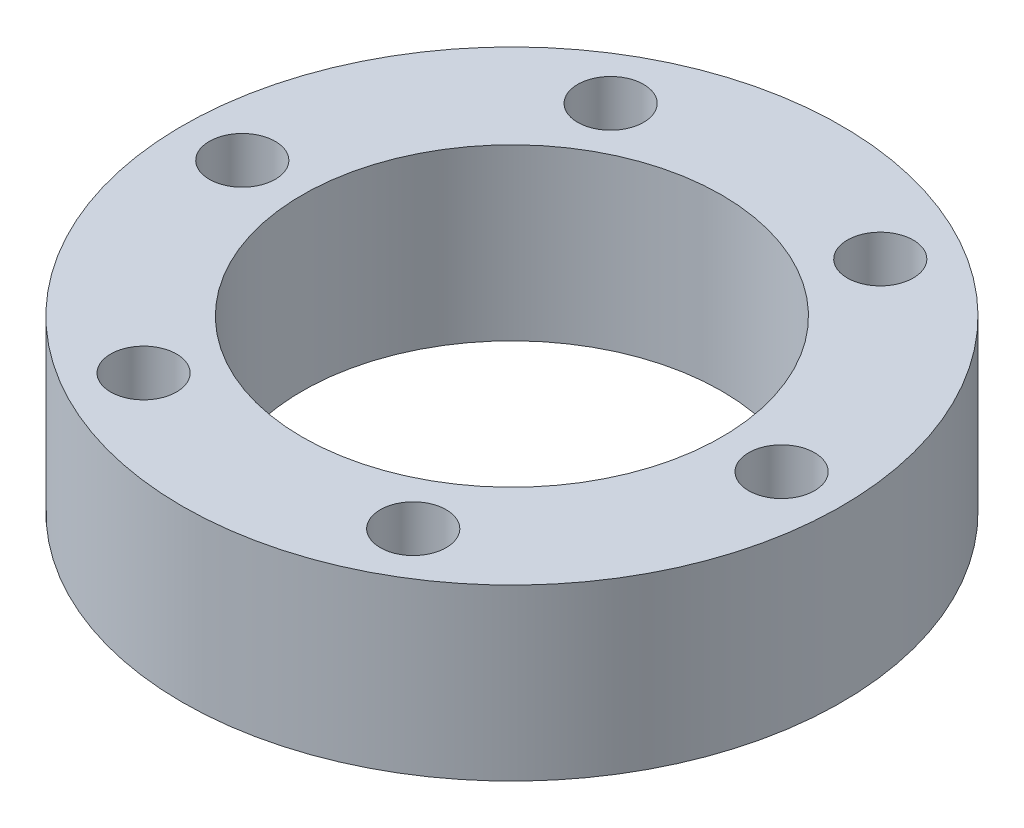
ISO-10303-21;
HEADER;
FILE_DESCRIPTION(('STEP AP214'),'2;1');
FILE_NAME('part.step','',(''),(''),'','','');
FILE_SCHEMA(('AUTOMOTIVE_DESIGN { 1 0 10303 214 1 1 1 1 }'));
ENDSEC;
DATA;
#1=APPLICATION_CONTEXT('core data for automotive mechanical design processes');
#2=APPLICATION_PROTOCOL_DEFINITION('international standard','automotive_design',2000,#1);
#3=PRODUCT_CONTEXT('',#1,'mechanical');
#4=PRODUCT('Part','Part','',(#3));
#5=PRODUCT_RELATED_PRODUCT_CATEGORY('part','',(#4));
#6=PRODUCT_DEFINITION_FORMATION('','',#4);
#7=PRODUCT_DEFINITION_CONTEXT('part definition',#1,'design');
#8=PRODUCT_DEFINITION('design','',#6,#7);
#9=PRODUCT_DEFINITION_SHAPE('','',#8);
#10=(LENGTH_UNIT() NAMED_UNIT(*) SI_UNIT(.MILLI.,.METRE.));
#11=(NAMED_UNIT(*) PLANE_ANGLE_UNIT() SI_UNIT($,.RADIAN.));
#12=(NAMED_UNIT(*) SI_UNIT($,.STERADIAN.) SOLID_ANGLE_UNIT());
#13=UNCERTAINTY_MEASURE_WITH_UNIT(LENGTH_MEASURE(1.E-05),#10,'distance_accuracy_value','');
#14=(GEOMETRIC_REPRESENTATION_CONTEXT(3) GLOBAL_UNCERTAINTY_ASSIGNED_CONTEXT((#13)) GLOBAL_UNIT_ASSIGNED_CONTEXT((#10,
#11,#12)) REPRESENTATION_CONTEXT('',''));
#15=CARTESIAN_POINT('',(0.,0.,0.));
#16=DIRECTION('',(0.,0.,1.));
#17=DIRECTION('',(1.,0.,0.));
#18=AXIS2_PLACEMENT_3D('',#15,#16,#17);
#19=CARTESIAN_POINT('',(0.,17.,0.));
#20=DIRECTION('',(0.,1.,0.));
#21=DIRECTION('',(0.,0.,1.));
#22=AXIS2_PLACEMENT_3D('',#19,#20,#21);
#23=PLANE('',#22);
#24=CARTESIAN_POINT('',(-13.5000000000003,17.,-23.3826859021797));
#25=DIRECTION('',(0.,1.,0.));
#26=DIRECTION('',(0.,0.,1.));
#27=AXIS2_PLACEMENT_3D('',#24,#25,#26);
#28=CIRCLE('',#27,3.29999999999999);
#29=CARTESIAN_POINT('',(-13.5000000000003,17.,-20.0826859021797));
#30=VERTEX_POINT('',#29);
#31=EDGE_CURVE('E83',#30,#30,#28,.T.);
#32=ORIENTED_EDGE('',*,*,#31,.F.);
#33=EDGE_LOOP('',(#32));
#34=FACE_BOUND('',#33,.T.);
#35=CARTESIAN_POINT('',(13.4999999999998,17.,-23.38268590218));
#36=DIRECTION('',(0.,1.,0.));
#37=DIRECTION('',(0.,0.,1.));
#38=AXIS2_PLACEMENT_3D('',#35,#36,#37);
#39=CIRCLE('',#38,3.29999999999999);
#40=CARTESIAN_POINT('',(13.4999999999998,17.,-20.08268590218));
#41=VERTEX_POINT('',#40);
#42=EDGE_CURVE('E77',#41,#41,#39,.T.);
#43=ORIENTED_EDGE('',*,*,#42,.F.);
#44=EDGE_LOOP('',(#43));
#45=FACE_BOUND('',#44,.T.);
#46=CARTESIAN_POINT('',(27.,17.,0.));
#47=DIRECTION('',(0.,1.,0.));
#48=DIRECTION('',(0.,0.,1.));
#49=AXIS2_PLACEMENT_3D('',#46,#47,#48);
#50=CIRCLE('',#49,3.29999999999999);
#51=CARTESIAN_POINT('',(27.,17.,3.29999999999999));
#52=VERTEX_POINT('',#51);
#53=EDGE_CURVE('E71',#52,#52,#50,.T.);
#54=ORIENTED_EDGE('',*,*,#53,.F.);
#55=EDGE_LOOP('',(#54));
#56=FACE_BOUND('',#55,.T.);
#57=CARTESIAN_POINT('',(13.5000000000001,17.,23.3826859021798));
#58=DIRECTION('',(0.,1.,0.));
#59=DIRECTION('',(0.,0.,1.));
#60=AXIS2_PLACEMENT_3D('',#57,#58,#59);
#61=CIRCLE('',#60,3.29999999999999);
#62=CARTESIAN_POINT('',(13.5000000000001,17.,26.6826859021798));
#63=VERTEX_POINT('',#62);
#64=EDGE_CURVE('E65',#63,#63,#61,.T.);
#65=ORIENTED_EDGE('',*,*,#64,.F.);
#66=EDGE_LOOP('',(#65));
#67=FACE_BOUND('',#66,.T.);
#68=CARTESIAN_POINT('',(-13.4999999999999,17.,23.3826859021799));
#69=DIRECTION('',(0.,1.,0.));
#70=DIRECTION('',(0.,0.,1.));
#71=AXIS2_PLACEMENT_3D('',#68,#69,#70);
#72=CIRCLE('',#71,3.29999999999999);
#73=CARTESIAN_POINT('',(-13.4999999999999,17.,26.6826859021799));
#74=VERTEX_POINT('',#73);
#75=EDGE_CURVE('E59',#74,#74,#72,.T.);
#76=ORIENTED_EDGE('',*,*,#75,.F.);
#77=EDGE_LOOP('',(#76));
#78=FACE_BOUND('',#77,.T.);
#79=CARTESIAN_POINT('',(-27.,17.,0.));
#80=DIRECTION('',(0.,1.,0.));
#81=DIRECTION('',(0.,0.,1.));
#82=AXIS2_PLACEMENT_3D('',#79,#80,#81);
#83=CIRCLE('',#82,3.29999999999999);
#84=CARTESIAN_POINT('',(-27.,17.,3.29999999999999));
#85=VERTEX_POINT('',#84);
#86=EDGE_CURVE('E53',#85,#85,#83,.T.);
#87=ORIENTED_EDGE('',*,*,#86,.F.);
#88=EDGE_LOOP('',(#87));
#89=FACE_BOUND('',#88,.T.);
#90=CARTESIAN_POINT('',(0.,17.,0.));
#91=DIRECTION('',(0.,1.,0.));
#92=DIRECTION('',(0.,0.,1.));
#93=AXIS2_PLACEMENT_3D('',#90,#91,#92);
#94=CIRCLE('',#93,33.);
#95=CARTESIAN_POINT('',(0.,17.,33.));
#96=VERTEX_POINT('',#95);
#97=EDGE_CURVE('E10',#96,#96,#94,.T.);
#98=ORIENTED_EDGE('',*,*,#97,.T.);
#99=EDGE_LOOP('',(#98));
#100=FACE_BOUND('',#99,.T.);
#101=CARTESIAN_POINT('',(0.,17.,0.));
#102=DIRECTION('',(0.,1.,0.));
#103=DIRECTION('',(0.,0.,1.));
#104=AXIS2_PLACEMENT_3D('',#101,#102,#103);
#105=CIRCLE('',#104,21.);
#106=CARTESIAN_POINT('',(0.,17.,21.));
#107=VERTEX_POINT('',#106);
#108=EDGE_CURVE('E43',#107,#107,#105,.T.);
#109=ORIENTED_EDGE('',*,*,#108,.F.);
#110=EDGE_LOOP('',(#109));
#111=FACE_BOUND('',#110,.T.);
#112=ADVANCED_FACE('F32',(#34,#45,#56,#67,#78,#89,#100,#111),#23,.T.);
#113=CARTESIAN_POINT('',(0.,0.,0.));
#114=DIRECTION('',(0.,1.,0.));
#115=DIRECTION('',(0.,0.,1.));
#116=AXIS2_PLACEMENT_3D('',#113,#114,#115);
#117=PLANE('',#116);
#118=CARTESIAN_POINT('',(-13.5000000000003,0.,-23.3826859021797));
#119=DIRECTION('',(0.,1.,0.));
#120=DIRECTION('',(0.,0.,1.));
#121=AXIS2_PLACEMENT_3D('',#118,#119,#120);
#122=CIRCLE('',#121,3.29999999999999);
#123=CARTESIAN_POINT('',(-13.5000000000003,0.,-20.0826859021797));
#124=VERTEX_POINT('',#123);
#125=EDGE_CURVE('E80',#124,#124,#122,.T.);
#126=ORIENTED_EDGE('',*,*,#125,.T.);
#127=EDGE_LOOP('',(#126));
#128=FACE_BOUND('',#127,.T.);
#129=CARTESIAN_POINT('',(13.4999999999998,0.,-23.38268590218));
#130=DIRECTION('',(0.,1.,0.));
#131=DIRECTION('',(0.,0.,1.));
#132=AXIS2_PLACEMENT_3D('',#129,#130,#131);
#133=CIRCLE('',#132,3.29999999999999);
#134=CARTESIAN_POINT('',(13.4999999999998,0.,-20.08268590218));
#135=VERTEX_POINT('',#134);
#136=EDGE_CURVE('E74',#135,#135,#133,.T.);
#137=ORIENTED_EDGE('',*,*,#136,.T.);
#138=EDGE_LOOP('',(#137));
#139=FACE_BOUND('',#138,.T.);
#140=CARTESIAN_POINT('',(27.,0.,0.));
#141=DIRECTION('',(0.,1.,0.));
#142=DIRECTION('',(0.,0.,1.));
#143=AXIS2_PLACEMENT_3D('',#140,#141,#142);
#144=CIRCLE('',#143,3.29999999999999);
#145=CARTESIAN_POINT('',(27.,0.,3.29999999999999));
#146=VERTEX_POINT('',#145);
#147=EDGE_CURVE('E68',#146,#146,#144,.T.);
#148=ORIENTED_EDGE('',*,*,#147,.T.);
#149=EDGE_LOOP('',(#148));
#150=FACE_BOUND('',#149,.T.);
#151=CARTESIAN_POINT('',(13.5000000000001,0.,23.3826859021798));
#152=DIRECTION('',(0.,1.,0.));
#153=DIRECTION('',(0.,0.,1.));
#154=AXIS2_PLACEMENT_3D('',#151,#152,#153);
#155=CIRCLE('',#154,3.29999999999999);
#156=CARTESIAN_POINT('',(13.5000000000001,0.,26.6826859021798));
#157=VERTEX_POINT('',#156);
#158=EDGE_CURVE('E62',#157,#157,#155,.T.);
#159=ORIENTED_EDGE('',*,*,#158,.T.);
#160=EDGE_LOOP('',(#159));
#161=FACE_BOUND('',#160,.T.);
#162=CARTESIAN_POINT('',(-13.4999999999999,0.,23.3826859021799));
#163=DIRECTION('',(0.,1.,0.));
#164=DIRECTION('',(0.,0.,1.));
#165=AXIS2_PLACEMENT_3D('',#162,#163,#164);
#166=CIRCLE('',#165,3.29999999999999);
#167=CARTESIAN_POINT('',(-13.4999999999999,0.,26.6826859021799));
#168=VERTEX_POINT('',#167);
#169=EDGE_CURVE('E56',#168,#168,#166,.T.);
#170=ORIENTED_EDGE('',*,*,#169,.T.);
#171=EDGE_LOOP('',(#170));
#172=FACE_BOUND('',#171,.T.);
#173=CARTESIAN_POINT('',(-27.,0.,0.));
#174=DIRECTION('',(0.,1.,0.));
#175=DIRECTION('',(0.,0.,1.));
#176=AXIS2_PLACEMENT_3D('',#173,#174,#175);
#177=CIRCLE('',#176,3.29999999999999);
#178=CARTESIAN_POINT('',(-27.,0.,3.29999999999999));
#179=VERTEX_POINT('',#178);
#180=EDGE_CURVE('E48',#179,#179,#177,.T.);
#181=ORIENTED_EDGE('',*,*,#180,.T.);
#182=EDGE_LOOP('',(#181));
#183=FACE_BOUND('',#182,.T.);
#184=CARTESIAN_POINT('',(0.,0.,0.));
#185=DIRECTION('',(0.,1.,0.));
#186=DIRECTION('',(0.,0.,1.));
#187=AXIS2_PLACEMENT_3D('',#184,#185,#186);
#188=CIRCLE('',#187,33.);
#189=CARTESIAN_POINT('',(0.,0.,33.));
#190=VERTEX_POINT('',#189);
#191=EDGE_CURVE('E36',#190,#190,#188,.T.);
#192=ORIENTED_EDGE('',*,*,#191,.F.);
#193=EDGE_LOOP('',(#192));
#194=FACE_BOUND('',#193,.T.);
#195=CARTESIAN_POINT('',(0.,0.,0.));
#196=DIRECTION('',(0.,1.,0.));
#197=DIRECTION('',(0.,0.,1.));
#198=AXIS2_PLACEMENT_3D('',#195,#196,#197);
#199=CIRCLE('',#198,21.);
#200=CARTESIAN_POINT('',(0.,0.,21.));
#201=VERTEX_POINT('',#200);
#202=EDGE_CURVE('E45',#201,#201,#199,.T.);
#203=ORIENTED_EDGE('',*,*,#202,.T.);
#204=EDGE_LOOP('',(#203));
#205=FACE_BOUND('',#204,.T.);
#206=ADVANCED_FACE('F91',(#128,#139,#150,#161,#172,#183,#194,#205),#117,.F.);
#207=CARTESIAN_POINT('',(0.,17.,0.));
#208=DIRECTION('',(0.,-1.,0.));
#209=DIRECTION('',(0.,0.,-1.));
#210=AXIS2_PLACEMENT_3D('',#207,#208,#209);
#211=CYLINDRICAL_SURFACE('',#210,33.);
#212=ORIENTED_EDGE('',*,*,#97,.F.);
#213=EDGE_LOOP('',(#212));
#214=FACE_BOUND('',#213,.T.);
#215=ORIENTED_EDGE('',*,*,#191,.T.);
#216=EDGE_LOOP('',(#215));
#217=FACE_BOUND('',#216,.T.);
#218=ADVANCED_FACE('F34',(#214,#217),#211,.T.);
#219=CARTESIAN_POINT('',(0.,17.,0.));
#220=DIRECTION('',(0.,-1.,0.));
#221=DIRECTION('',(0.,0.,-1.));
#222=AXIS2_PLACEMENT_3D('',#219,#220,#221);
#223=CYLINDRICAL_SURFACE('',#222,21.);
#224=ORIENTED_EDGE('',*,*,#108,.T.);
#225=EDGE_LOOP('',(#224));
#226=FACE_BOUND('',#225,.T.);
#227=ORIENTED_EDGE('',*,*,#202,.F.);
#228=EDGE_LOOP('',(#227));
#229=FACE_BOUND('',#228,.T.);
#230=ADVANCED_FACE('F105',(#226,#229),#223,.F.);
#231=CARTESIAN_POINT('',(-27.,17.,0.));
#232=DIRECTION('',(0.,1.,0.));
#233=DIRECTION('',(0.,0.,1.));
#234=AXIS2_PLACEMENT_3D('',#231,#232,#233);
#235=CYLINDRICAL_SURFACE('',#234,3.29999999999999);
#236=ORIENTED_EDGE('',*,*,#180,.F.);
#237=EDGE_LOOP('',(#236));
#238=FACE_BOUND('',#237,.T.);
#239=ORIENTED_EDGE('',*,*,#86,.T.);
#240=EDGE_LOOP('',(#239));
#241=FACE_BOUND('',#240,.T.);
#242=ADVANCED_FACE('F108',(#238,#241),#235,.F.);
#243=CARTESIAN_POINT('',(-13.4999999999999,17.,23.3826859021799));
#244=DIRECTION('',(0.,1.,0.));
#245=DIRECTION('',(0.,0.,1.));
#246=AXIS2_PLACEMENT_3D('',#243,#244,#245);
#247=CYLINDRICAL_SURFACE('',#246,3.29999999999999);
#248=ORIENTED_EDGE('',*,*,#169,.F.);
#249=EDGE_LOOP('',(#248));
#250=FACE_BOUND('',#249,.T.);
#251=ORIENTED_EDGE('',*,*,#75,.T.);
#252=EDGE_LOOP('',(#251));
#253=FACE_BOUND('',#252,.T.);
#254=ADVANCED_FACE('F122',(#250,#253),#247,.F.);
#255=CARTESIAN_POINT('',(13.5000000000001,17.,23.3826859021798));
#256=DIRECTION('',(0.,1.,0.));
#257=DIRECTION('',(0.,0.,1.));
#258=AXIS2_PLACEMENT_3D('',#255,#256,#257);
#259=CYLINDRICAL_SURFACE('',#258,3.29999999999999);
#260=ORIENTED_EDGE('',*,*,#158,.F.);
#261=EDGE_LOOP('',(#260));
#262=FACE_BOUND('',#261,.T.);
#263=ORIENTED_EDGE('',*,*,#64,.T.);
#264=EDGE_LOOP('',(#263));
#265=FACE_BOUND('',#264,.T.);
#266=ADVANCED_FACE('F126',(#262,#265),#259,.F.);
#267=CARTESIAN_POINT('',(27.,17.,0.));
#268=DIRECTION('',(0.,1.,0.));
#269=DIRECTION('',(0.,0.,1.));
#270=AXIS2_PLACEMENT_3D('',#267,#268,#269);
#271=CYLINDRICAL_SURFACE('',#270,3.29999999999999);
#272=ORIENTED_EDGE('',*,*,#147,.F.);
#273=EDGE_LOOP('',(#272));
#274=FACE_BOUND('',#273,.T.);
#275=ORIENTED_EDGE('',*,*,#53,.T.);
#276=EDGE_LOOP('',(#275));
#277=FACE_BOUND('',#276,.T.);
#278=ADVANCED_FACE('F130',(#274,#277),#271,.F.);
#279=CARTESIAN_POINT('',(13.4999999999998,17.,-23.38268590218));
#280=DIRECTION('',(0.,1.,0.));
#281=DIRECTION('',(0.,0.,1.));
#282=AXIS2_PLACEMENT_3D('',#279,#280,#281);
#283=CYLINDRICAL_SURFACE('',#282,3.29999999999999);
#284=ORIENTED_EDGE('',*,*,#136,.F.);
#285=EDGE_LOOP('',(#284));
#286=FACE_BOUND('',#285,.T.);
#287=ORIENTED_EDGE('',*,*,#42,.T.);
#288=EDGE_LOOP('',(#287));
#289=FACE_BOUND('',#288,.T.);
#290=ADVANCED_FACE('F134',(#286,#289),#283,.F.);
#291=CARTESIAN_POINT('',(-13.5000000000003,17.,-23.3826859021797));
#292=DIRECTION('',(0.,1.,0.));
#293=DIRECTION('',(0.,0.,1.));
#294=AXIS2_PLACEMENT_3D('',#291,#292,#293);
#295=CYLINDRICAL_SURFACE('',#294,3.29999999999999);
#296=ORIENTED_EDGE('',*,*,#125,.F.);
#297=EDGE_LOOP('',(#296));
#298=FACE_BOUND('',#297,.T.);
#299=ORIENTED_EDGE('',*,*,#31,.T.);
#300=EDGE_LOOP('',(#299));
#301=FACE_BOUND('',#300,.T.);
#302=ADVANCED_FACE('F87',(#298,#301),#295,.F.);
#303=CLOSED_SHELL('',(#112,#206,#218,#230,#242,#254,#266,#278,#290,#302));
#304=MANIFOLD_SOLID_BREP('B2',#303);
#305=ADVANCED_BREP_SHAPE_REPRESENTATION('',(#18,#304),#14);
#306=SHAPE_DEFINITION_REPRESENTATION(#9,#305);
ENDSEC;
END-ISO-10303-21;
